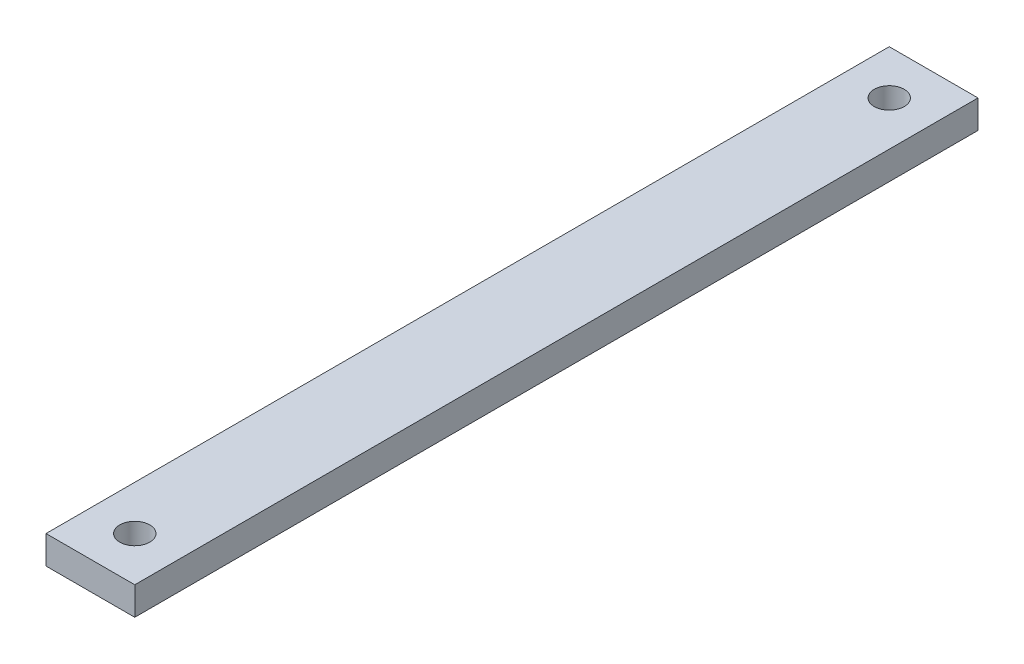
ISO-10303-21;
HEADER;
FILE_DESCRIPTION(('STEP AP214'),'2;1');
FILE_NAME('part.step','',(''),(''),'','','');
FILE_SCHEMA(('AUTOMOTIVE_DESIGN { 1 0 10303 214 1 1 1 1 }'));
ENDSEC;
DATA;
#1=APPLICATION_CONTEXT('core data for automotive mechanical design processes');
#2=APPLICATION_PROTOCOL_DEFINITION('international standard','automotive_design',2000,#1);
#3=PRODUCT_CONTEXT('',#1,'mechanical');
#4=PRODUCT('Part','Part','',(#3));
#5=PRODUCT_RELATED_PRODUCT_CATEGORY('part','',(#4));
#6=PRODUCT_DEFINITION_FORMATION('','',#4);
#7=PRODUCT_DEFINITION_CONTEXT('part definition',#1,'design');
#8=PRODUCT_DEFINITION('design','',#6,#7);
#9=PRODUCT_DEFINITION_SHAPE('','',#8);
#10=(LENGTH_UNIT() NAMED_UNIT(*) SI_UNIT(.MILLI.,.METRE.));
#11=(NAMED_UNIT(*) PLANE_ANGLE_UNIT() SI_UNIT($,.RADIAN.));
#12=(NAMED_UNIT(*) SI_UNIT($,.STERADIAN.) SOLID_ANGLE_UNIT());
#13=UNCERTAINTY_MEASURE_WITH_UNIT(LENGTH_MEASURE(1.E-05),#10,'distance_accuracy_value','');
#14=(GEOMETRIC_REPRESENTATION_CONTEXT(3) GLOBAL_UNCERTAINTY_ASSIGNED_CONTEXT((#13)) GLOBAL_UNIT_ASSIGNED_CONTEXT((#10,
#11,#12)) REPRESENTATION_CONTEXT('',''));
#15=CARTESIAN_POINT('',(0.,0.,0.));
#16=DIRECTION('',(0.,0.,1.));
#17=DIRECTION('',(1.,0.,0.));
#18=AXIS2_PLACEMENT_3D('',#15,#16,#17);
#19=CARTESIAN_POINT('',(0.,6.35,0.));
#20=DIRECTION('',(0.,1.,0.));
#21=DIRECTION('',(0.,0.,1.));
#22=AXIS2_PLACEMENT_3D('',#19,#20,#21);
#23=PLANE('',#22);
#24=CARTESIAN_POINT('',(10.,6.35,-9.99999999999998));
#25=DIRECTION('',(0.,1.,0.));
#26=DIRECTION('',(0.,0.,1.));
#27=AXIS2_PLACEMENT_3D('',#24,#25,#26);
#28=CIRCLE('',#27,3.38);
#29=CARTESIAN_POINT('',(10.,6.35,-6.61999999999998));
#30=VERTEX_POINT('',#29);
#31=EDGE_CURVE('E110',#30,#30,#28,.T.);
#32=ORIENTED_EDGE('',*,*,#31,.F.);
#33=EDGE_LOOP('',(#32));
#34=FACE_BOUND('',#33,.T.);
#35=DIRECTION('',(0.,0.,1.));
#36=VECTOR('',#35,1.);
#37=CARTESIAN_POINT('',(0.,6.35,-190.));
#38=LINE('',#37,#36);
#39=CARTESIAN_POINT('',(0.,6.35,-190.));
#40=VERTEX_POINT('',#39);
#41=CARTESIAN_POINT('',(0.,6.35,0.));
#42=VERTEX_POINT('',#41);
#43=EDGE_CURVE('E95',#40,#42,#38,.T.);
#44=ORIENTED_EDGE('',*,*,#43,.T.);
#45=DIRECTION('',(1.,0.,0.));
#46=VECTOR('',#45,1.);
#47=CARTESIAN_POINT('',(0.,6.35,0.));
#48=LINE('',#47,#46);
#49=CARTESIAN_POINT('',(20.,6.35,0.));
#50=VERTEX_POINT('',#49);
#51=EDGE_CURVE('E90',#42,#50,#48,.T.);
#52=ORIENTED_EDGE('',*,*,#51,.T.);
#53=DIRECTION('',(0.,0.,-1.));
#54=VECTOR('',#53,1.);
#55=CARTESIAN_POINT('',(20.,6.35,-190.));
#56=LINE('',#55,#54);
#57=CARTESIAN_POINT('',(20.,6.35,-190.));
#58=VERTEX_POINT('',#57);
#59=EDGE_CURVE('E93',#50,#58,#56,.T.);
#60=ORIENTED_EDGE('',*,*,#59,.T.);
#61=DIRECTION('',(-1.,0.,0.));
#62=VECTOR('',#61,1.);
#63=CARTESIAN_POINT('',(0.,6.35,-190.));
#64=LINE('',#63,#62);
#65=EDGE_CURVE('E60',#58,#40,#64,.T.);
#66=ORIENTED_EDGE('',*,*,#65,.T.);
#67=EDGE_LOOP('',(#44,#52,#60,#66));
#68=FACE_BOUND('',#67,.T.);
#69=CARTESIAN_POINT('',(10.,6.35,-180.));
#70=DIRECTION('',(0.,1.,0.));
#71=DIRECTION('',(0.,0.,1.));
#72=AXIS2_PLACEMENT_3D('',#69,#70,#71);
#73=CIRCLE('',#72,3.38000000000001);
#74=CARTESIAN_POINT('',(10.,6.35,-176.62));
#75=VERTEX_POINT('',#74);
#76=EDGE_CURVE('E125',#75,#75,#73,.T.);
#77=ORIENTED_EDGE('',*,*,#76,.F.);
#78=EDGE_LOOP('',(#77));
#79=FACE_BOUND('',#78,.T.);
#80=ADVANCED_FACE('F43',(#34,#68,#79),#23,.T.);
#81=CARTESIAN_POINT('',(0.,0.,0.));
#82=DIRECTION('',(0.,1.,0.));
#83=DIRECTION('',(0.,0.,1.));
#84=AXIS2_PLACEMENT_3D('',#81,#82,#83);
#85=PLANE('',#84);
#86=DIRECTION('',(0.,0.,1.));
#87=VECTOR('',#86,1.);
#88=CARTESIAN_POINT('',(0.,0.,-190.));
#89=LINE('',#88,#87);
#90=CARTESIAN_POINT('',(0.,0.,-190.));
#91=VERTEX_POINT('',#90);
#92=CARTESIAN_POINT('',(0.,0.,0.));
#93=VERTEX_POINT('',#92);
#94=EDGE_CURVE('E107',#91,#93,#89,.T.);
#95=ORIENTED_EDGE('',*,*,#94,.F.);
#96=DIRECTION('',(-1.,0.,0.));
#97=VECTOR('',#96,1.);
#98=CARTESIAN_POINT('',(0.,0.,-190.));
#99=LINE('',#98,#97);
#100=CARTESIAN_POINT('',(20.,0.,-190.));
#101=VERTEX_POINT('',#100);
#102=EDGE_CURVE('E83',#101,#91,#99,.T.);
#103=ORIENTED_EDGE('',*,*,#102,.F.);
#104=DIRECTION('',(0.,0.,-1.));
#105=VECTOR('',#104,1.);
#106=CARTESIAN_POINT('',(20.,0.,-190.));
#107=LINE('',#106,#105);
#108=CARTESIAN_POINT('',(20.,0.,0.));
#109=VERTEX_POINT('',#108);
#110=EDGE_CURVE('E77',#109,#101,#107,.T.);
#111=ORIENTED_EDGE('',*,*,#110,.F.);
#112=DIRECTION('',(1.,0.,0.));
#113=VECTOR('',#112,1.);
#114=CARTESIAN_POINT('',(0.,0.,0.));
#115=LINE('',#114,#113);
#116=EDGE_CURVE('E99',#93,#109,#115,.T.);
#117=ORIENTED_EDGE('',*,*,#116,.F.);
#118=EDGE_LOOP('',(#95,#103,#111,#117));
#119=FACE_BOUND('',#118,.T.);
#120=CARTESIAN_POINT('',(10.,0.,-9.99999999999998));
#121=DIRECTION('',(0.,1.,0.));
#122=DIRECTION('',(0.,0.,1.));
#123=AXIS2_PLACEMENT_3D('',#120,#121,#122);
#124=CIRCLE('',#123,3.38);
#125=CARTESIAN_POINT('',(10.,0.,-6.61999999999998));
#126=VERTEX_POINT('',#125);
#127=EDGE_CURVE('E122',#126,#126,#124,.T.);
#128=ORIENTED_EDGE('',*,*,#127,.T.);
#129=EDGE_LOOP('',(#128));
#130=FACE_BOUND('',#129,.T.);
#131=CARTESIAN_POINT('',(10.,0.,-180.));
#132=DIRECTION('',(0.,1.,0.));
#133=DIRECTION('',(0.,0.,1.));
#134=AXIS2_PLACEMENT_3D('',#131,#132,#133);
#135=CIRCLE('',#134,3.38000000000001);
#136=CARTESIAN_POINT('',(10.,0.,-176.62));
#137=VERTEX_POINT('',#136);
#138=EDGE_CURVE('E128',#137,#137,#135,.T.);
#139=ORIENTED_EDGE('',*,*,#138,.T.);
#140=EDGE_LOOP('',(#139));
#141=FACE_BOUND('',#140,.T.);
#142=ADVANCED_FACE('F118',(#119,#130,#141),#85,.F.);
#143=CARTESIAN_POINT('',(0.,6.35,-190.));
#144=DIRECTION('',(1.,0.,0.));
#145=DIRECTION('',(0.,0.,-1.));
#146=AXIS2_PLACEMENT_3D('',#143,#144,#145);
#147=PLANE('',#146);
#148=ORIENTED_EDGE('',*,*,#94,.T.);
#149=DIRECTION('',(0.,-1.,0.));
#150=VECTOR('',#149,1.);
#151=CARTESIAN_POINT('',(0.,6.35,0.));
#152=LINE('',#151,#150);
#153=EDGE_CURVE('E11',#42,#93,#152,.T.);
#154=ORIENTED_EDGE('',*,*,#153,.F.);
#155=ORIENTED_EDGE('',*,*,#43,.F.);
#156=DIRECTION('',(0.,-1.,0.));
#157=VECTOR('',#156,1.);
#158=CARTESIAN_POINT('',(0.,6.35,-190.));
#159=LINE('',#158,#157);
#160=EDGE_CURVE('E103',#40,#91,#159,.T.);
#161=ORIENTED_EDGE('',*,*,#160,.T.);
#162=EDGE_LOOP('',(#148,#154,#155,#161));
#163=FACE_BOUND('',#162,.T.);
#164=ADVANCED_FACE('F45',(#163),#147,.F.);
#165=CARTESIAN_POINT('',(0.,6.35,0.));
#166=DIRECTION('',(0.,0.,-1.));
#167=DIRECTION('',(-1.,0.,0.));
#168=AXIS2_PLACEMENT_3D('',#165,#166,#167);
#169=PLANE('',#168);
#170=ORIENTED_EDGE('',*,*,#116,.T.);
#171=DIRECTION('',(0.,-1.,0.));
#172=VECTOR('',#171,1.);
#173=CARTESIAN_POINT('',(20.,6.35,0.));
#174=LINE('',#173,#172);
#175=EDGE_CURVE('E52',#50,#109,#174,.T.);
#176=ORIENTED_EDGE('',*,*,#175,.F.);
#177=ORIENTED_EDGE('',*,*,#51,.F.);
#178=ORIENTED_EDGE('',*,*,#153,.T.);
#179=EDGE_LOOP('',(#170,#176,#177,#178));
#180=FACE_BOUND('',#179,.T.);
#181=ADVANCED_FACE('F98',(#180),#169,.F.);
#182=CARTESIAN_POINT('',(20.,6.35,-190.));
#183=DIRECTION('',(-1.,0.,0.));
#184=DIRECTION('',(0.,0.,1.));
#185=AXIS2_PLACEMENT_3D('',#182,#183,#184);
#186=PLANE('',#185);
#187=ORIENTED_EDGE('',*,*,#110,.T.);
#188=DIRECTION('',(0.,-1.,0.));
#189=VECTOR('',#188,1.);
#190=CARTESIAN_POINT('',(20.,6.35,-190.));
#191=LINE('',#190,#189);
#192=EDGE_CURVE('E100',#58,#101,#191,.T.);
#193=ORIENTED_EDGE('',*,*,#192,.F.);
#194=ORIENTED_EDGE('',*,*,#59,.F.);
#195=ORIENTED_EDGE('',*,*,#175,.T.);
#196=EDGE_LOOP('',(#187,#193,#194,#195));
#197=FACE_BOUND('',#196,.T.);
#198=ADVANCED_FACE('F101',(#197),#186,.F.);
#199=CARTESIAN_POINT('',(0.,6.35,-190.));
#200=DIRECTION('',(0.,0.,1.));
#201=DIRECTION('',(1.,0.,0.));
#202=AXIS2_PLACEMENT_3D('',#199,#200,#201);
#203=PLANE('',#202);
#204=ORIENTED_EDGE('',*,*,#102,.T.);
#205=ORIENTED_EDGE('',*,*,#160,.F.);
#206=ORIENTED_EDGE('',*,*,#65,.F.);
#207=ORIENTED_EDGE('',*,*,#192,.T.);
#208=EDGE_LOOP('',(#204,#205,#206,#207));
#209=FACE_BOUND('',#208,.T.);
#210=ADVANCED_FACE('F115',(#209),#203,.F.);
#211=CARTESIAN_POINT('',(10.,6.35,-9.99999999999998));
#212=DIRECTION('',(0.,-1.,0.));
#213=DIRECTION('',(0.,0.,-1.));
#214=AXIS2_PLACEMENT_3D('',#211,#212,#213);
#215=CYLINDRICAL_SURFACE('',#214,3.38);
#216=ORIENTED_EDGE('',*,*,#31,.T.);
#217=EDGE_LOOP('',(#216));
#218=FACE_BOUND('',#217,.T.);
#219=ORIENTED_EDGE('',*,*,#127,.F.);
#220=EDGE_LOOP('',(#219));
#221=FACE_BOUND('',#220,.T.);
#222=ADVANCED_FACE('F145',(#218,#221),#215,.F.);
#223=CARTESIAN_POINT('',(10.,6.35,-180.));
#224=DIRECTION('',(0.,-1.,0.));
#225=DIRECTION('',(0.,0.,-1.));
#226=AXIS2_PLACEMENT_3D('',#223,#224,#225);
#227=CYLINDRICAL_SURFACE('',#226,3.38000000000001);
#228=ORIENTED_EDGE('',*,*,#76,.T.);
#229=EDGE_LOOP('',(#228));
#230=FACE_BOUND('',#229,.T.);
#231=ORIENTED_EDGE('',*,*,#138,.F.);
#232=EDGE_LOOP('',(#231));
#233=FACE_BOUND('',#232,.T.);
#234=ADVANCED_FACE('F134',(#230,#233),#227,.F.);
#235=CLOSED_SHELL('',(#80,#142,#164,#181,#198,#210,#222,#234));
#236=MANIFOLD_SOLID_BREP('B2',#235);
#237=ADVANCED_BREP_SHAPE_REPRESENTATION('',(#18,#236),#14);
#238=SHAPE_DEFINITION_REPRESENTATION(#9,#237);
ENDSEC;
END-ISO-10303-21;
